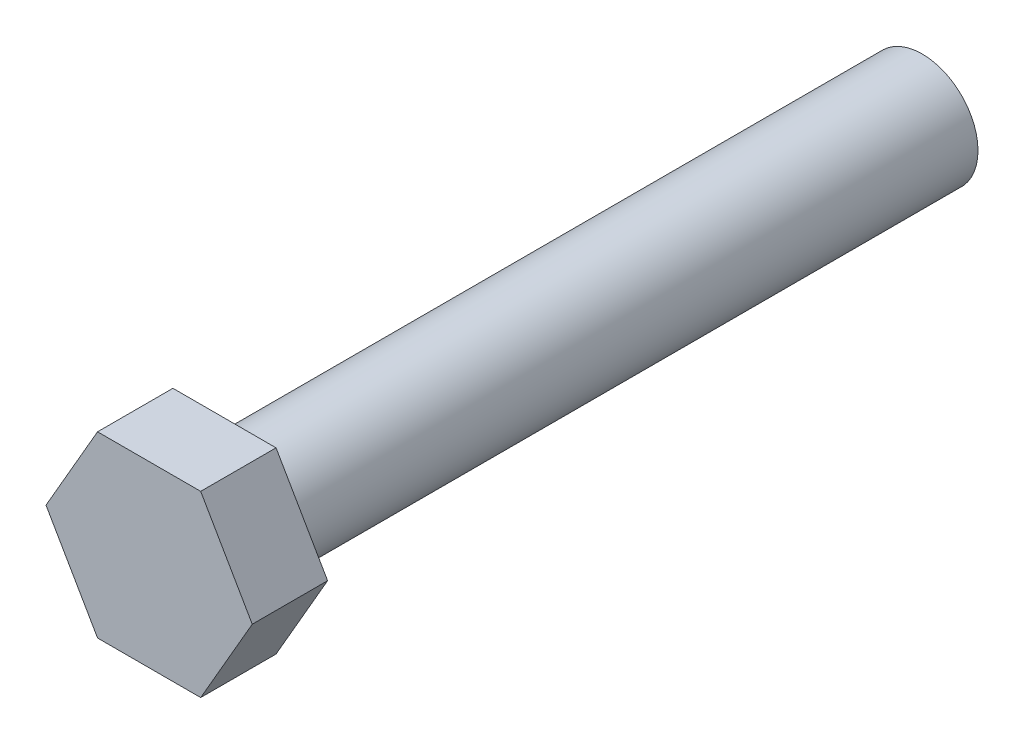
ISO-10303-21;
HEADER;
FILE_DESCRIPTION(('STEP AP214'),'2;1');
FILE_NAME('part.step','',(''),(''),'','','');
FILE_SCHEMA(('AUTOMOTIVE_DESIGN { 1 0 10303 214 1 1 1 1 }'));
ENDSEC;
DATA;
#1=APPLICATION_CONTEXT('core data for automotive mechanical design processes');
#2=APPLICATION_PROTOCOL_DEFINITION('international standard','automotive_design',2000,#1);
#3=PRODUCT_CONTEXT('',#1,'mechanical');
#4=PRODUCT('Part','Part','',(#3));
#5=PRODUCT_RELATED_PRODUCT_CATEGORY('part','',(#4));
#6=PRODUCT_DEFINITION_FORMATION('','',#4);
#7=PRODUCT_DEFINITION_CONTEXT('part definition',#1,'design');
#8=PRODUCT_DEFINITION('design','',#6,#7);
#9=PRODUCT_DEFINITION_SHAPE('','',#8);
#10=(LENGTH_UNIT() NAMED_UNIT(*) SI_UNIT(.MILLI.,.METRE.));
#11=(NAMED_UNIT(*) PLANE_ANGLE_UNIT() SI_UNIT($,.RADIAN.));
#12=(NAMED_UNIT(*) SI_UNIT($,.STERADIAN.) SOLID_ANGLE_UNIT());
#13=UNCERTAINTY_MEASURE_WITH_UNIT(LENGTH_MEASURE(1.E-05),#10,'distance_accuracy_value','');
#14=(GEOMETRIC_REPRESENTATION_CONTEXT(3) GLOBAL_UNCERTAINTY_ASSIGNED_CONTEXT((#13)) GLOBAL_UNIT_ASSIGNED_CONTEXT((#10,
#11,#12)) REPRESENTATION_CONTEXT('',''));
#15=CARTESIAN_POINT('',(0.,0.,0.));
#16=DIRECTION('',(0.,0.,1.));
#17=DIRECTION('',(1.,0.,0.));
#18=AXIS2_PLACEMENT_3D('',#15,#16,#17);
#19=CARTESIAN_POINT('',(0.,0.,50.));
#20=DIRECTION('',(0.,0.,-1.));
#21=DIRECTION('',(-1.,0.,0.));
#22=AXIS2_PLACEMENT_3D('',#19,#20,#21);
#23=CYLINDRICAL_SURFACE('',#22,4.);
#24=CARTESIAN_POINT('',(0.,0.,50.));
#25=DIRECTION('',(0.,0.,1.));
#26=DIRECTION('',(1.,0.,0.));
#27=AXIS2_PLACEMENT_3D('',#24,#25,#26);
#28=CIRCLE('',#27,4.);
#29=CARTESIAN_POINT('',(4.,0.,50.));
#30=VERTEX_POINT('',#29);
#31=EDGE_CURVE('E11',#30,#30,#28,.T.);
#32=ORIENTED_EDGE('',*,*,#31,.F.);
#33=EDGE_LOOP('',(#32));
#34=FACE_BOUND('',#33,.T.);
#35=CARTESIAN_POINT('',(0.,0.,0.));
#36=DIRECTION('',(0.,0.,1.));
#37=DIRECTION('',(1.,0.,0.));
#38=AXIS2_PLACEMENT_3D('',#35,#36,#37);
#39=CIRCLE('',#38,4.);
#40=CARTESIAN_POINT('',(4.,0.,0.));
#41=VERTEX_POINT('',#40);
#42=EDGE_CURVE('E37',#41,#41,#39,.T.);
#43=ORIENTED_EDGE('',*,*,#42,.T.);
#44=EDGE_LOOP('',(#43));
#45=FACE_BOUND('',#44,.T.);
#46=ADVANCED_FACE('F34',(#34,#45),#23,.T.);
#47=CARTESIAN_POINT('',(0.,0.,0.));
#48=DIRECTION('',(0.,0.,1.));
#49=DIRECTION('',(1.,0.,0.));
#50=AXIS2_PLACEMENT_3D('',#47,#48,#49);
#51=PLANE('',#50);
#52=ORIENTED_EDGE('',*,*,#42,.F.);
#53=EDGE_LOOP('',(#52));
#54=FACE_BOUND('',#53,.T.);
#55=ADVANCED_FACE('F142',(#54),#51,.F.);
#56=CARTESIAN_POINT('',(7.39008344562719,0.,50.));
#57=DIRECTION('',(0.,0.,1.));
#58=DIRECTION('',(1.,0.,0.));
#59=AXIS2_PLACEMENT_3D('',#56,#57,#58);
#60=PLANE('',#59);
#61=DIRECTION('',(0.499999999999999,0.866025403784439,0.));
#62=VECTOR('',#61,1.);
#63=CARTESIAN_POINT('',(3.69504172281362,-6.40000000000018,50.));
#64=LINE('',#63,#62);
#65=CARTESIAN_POINT('',(3.69504172281362,-6.40000000000018,50.));
#66=VERTEX_POINT('',#65);
#67=CARTESIAN_POINT('',(7.39008344562719,0.,50.));
#68=VERTEX_POINT('',#67);
#69=EDGE_CURVE('E119',#66,#68,#64,.T.);
#70=ORIENTED_EDGE('',*,*,#69,.F.);
#71=DIRECTION('',(1.,0.,0.));
#72=VECTOR('',#71,1.);
#73=CARTESIAN_POINT('',(-3.69504172281368,-6.40000000000007,50.));
#74=LINE('',#73,#72);
#75=CARTESIAN_POINT('',(-3.69504172281368,-6.40000000000007,50.));
#76=VERTEX_POINT('',#75);
#77=EDGE_CURVE('E79',#76,#66,#74,.T.);
#78=ORIENTED_EDGE('',*,*,#77,.F.);
#79=DIRECTION('',(0.5,-0.866025403784439,0.));
#80=VECTOR('',#79,1.);
#81=CARTESIAN_POINT('',(-7.39008344562722,0.,50.));
#82=LINE('',#81,#80);
#83=CARTESIAN_POINT('',(-7.39008344562722,0.,50.));
#84=VERTEX_POINT('',#83);
#85=EDGE_CURVE('E73',#84,#76,#82,.T.);
#86=ORIENTED_EDGE('',*,*,#85,.F.);
#87=DIRECTION('',(-0.5,-0.866025403784439,0.));
#88=VECTOR('',#87,1.);
#89=CARTESIAN_POINT('',(-3.69504172281362,6.39999999999996,50.));
#90=LINE('',#89,#88);
#91=CARTESIAN_POINT('',(-3.69504172281362,6.39999999999996,50.));
#92=VERTEX_POINT('',#91);
#93=EDGE_CURVE('E109',#92,#84,#90,.T.);
#94=ORIENTED_EDGE('',*,*,#93,.F.);
#95=DIRECTION('',(-1.,0.,0.));
#96=VECTOR('',#95,1.);
#97=CARTESIAN_POINT('',(3.69504172281351,6.39999999999996,50.));
#98=LINE('',#97,#96);
#99=CARTESIAN_POINT('',(3.69504172281351,6.39999999999996,50.));
#100=VERTEX_POINT('',#99);
#101=EDGE_CURVE('E124',#100,#92,#98,.T.);
#102=ORIENTED_EDGE('',*,*,#101,.F.);
#103=DIRECTION('',(-0.5,0.866025403784439,0.));
#104=VECTOR('',#103,1.);
#105=CARTESIAN_POINT('',(7.39008344562719,0.,50.));
#106=LINE('',#105,#104);
#107=EDGE_CURVE('E122',#68,#100,#106,.T.);
#108=ORIENTED_EDGE('',*,*,#107,.F.);
#109=EDGE_LOOP('',(#70,#78,#86,#94,#102,#108));
#110=FACE_BOUND('',#109,.T.);
#111=ORIENTED_EDGE('',*,*,#31,.T.);
#112=EDGE_LOOP('',(#111));
#113=FACE_BOUND('',#112,.T.);
#114=ADVANCED_FACE('F144',(#110,#113),#60,.F.);
#115=CARTESIAN_POINT('',(3.69504172281362,-6.40000000000018,55.4));
#116=DIRECTION('',(-0.866025403784439,0.5,0.));
#117=DIRECTION('',(-0.499999999999999,-0.866025403784439,0.));
#118=AXIS2_PLACEMENT_3D('',#115,#116,#117);
#119=PLANE('',#118);
#120=ORIENTED_EDGE('',*,*,#69,.T.);
#121=DIRECTION('',(0.,0.,-1.));
#122=VECTOR('',#121,1.);
#123=CARTESIAN_POINT('',(7.39008344562719,0.,55.4));
#124=LINE('',#123,#122);
#125=CARTESIAN_POINT('',(7.39008344562719,0.,55.4));
#126=VERTEX_POINT('',#125);
#127=EDGE_CURVE('E136',#126,#68,#124,.T.);
#128=ORIENTED_EDGE('',*,*,#127,.F.);
#129=DIRECTION('',(0.499999999999999,0.866025403784439,0.));
#130=VECTOR('',#129,1.);
#131=CARTESIAN_POINT('',(3.69504172281362,-6.40000000000018,55.4));
#132=LINE('',#131,#130);
#133=CARTESIAN_POINT('',(3.69504172281362,-6.40000000000018,55.4));
#134=VERTEX_POINT('',#133);
#135=EDGE_CURVE('E129',#134,#126,#132,.T.);
#136=ORIENTED_EDGE('',*,*,#135,.F.);
#137=DIRECTION('',(0.,0.,-1.));
#138=VECTOR('',#137,1.);
#139=CARTESIAN_POINT('',(3.69504172281362,-6.40000000000018,55.4));
#140=LINE('',#139,#138);
#141=EDGE_CURVE('E115',#134,#66,#140,.T.);
#142=ORIENTED_EDGE('',*,*,#141,.T.);
#143=EDGE_LOOP('',(#120,#128,#136,#142));
#144=FACE_BOUND('',#143,.T.);
#145=ADVANCED_FACE('F149',(#144),#119,.F.);
#146=CARTESIAN_POINT('',(7.39008344562719,0.,55.4));
#147=DIRECTION('',(-0.866025403784438,-0.5,0.));
#148=DIRECTION('',(0.5,-0.866025403784439,0.));
#149=AXIS2_PLACEMENT_3D('',#146,#147,#148);
#150=PLANE('',#149);
#151=ORIENTED_EDGE('',*,*,#107,.T.);
#152=DIRECTION('',(0.,0.,-1.));
#153=VECTOR('',#152,1.);
#154=CARTESIAN_POINT('',(3.69504172281351,6.39999999999996,55.4));
#155=LINE('',#154,#153);
#156=CARTESIAN_POINT('',(3.69504172281351,6.39999999999996,55.4));
#157=VERTEX_POINT('',#156);
#158=EDGE_CURVE('E133',#157,#100,#155,.T.);
#159=ORIENTED_EDGE('',*,*,#158,.F.);
#160=DIRECTION('',(-0.5,0.866025403784439,0.));
#161=VECTOR('',#160,1.);
#162=CARTESIAN_POINT('',(7.39008344562719,0.,55.4));
#163=LINE('',#162,#161);
#164=EDGE_CURVE('E88',#126,#157,#163,.T.);
#165=ORIENTED_EDGE('',*,*,#164,.F.);
#166=ORIENTED_EDGE('',*,*,#127,.T.);
#167=EDGE_LOOP('',(#151,#159,#165,#166));
#168=FACE_BOUND('',#167,.T.);
#169=ADVANCED_FACE('F156',(#168),#150,.F.);
#170=CARTESIAN_POINT('',(3.69504172281351,6.39999999999996,55.4));
#171=DIRECTION('',(0.,-1.,0.));
#172=DIRECTION('',(0.,0.,-1.));
#173=AXIS2_PLACEMENT_3D('',#170,#171,#172);
#174=PLANE('',#173);
#175=ORIENTED_EDGE('',*,*,#101,.T.);
#176=DIRECTION('',(0.,0.,-1.));
#177=VECTOR('',#176,1.);
#178=CARTESIAN_POINT('',(-3.69504172281362,6.39999999999996,55.4));
#179=LINE('',#178,#177);
#180=CARTESIAN_POINT('',(-3.69504172281362,6.39999999999996,55.4));
#181=VERTEX_POINT('',#180);
#182=EDGE_CURVE('E110',#181,#92,#179,.T.);
#183=ORIENTED_EDGE('',*,*,#182,.F.);
#184=DIRECTION('',(-1.,0.,0.));
#185=VECTOR('',#184,1.);
#186=CARTESIAN_POINT('',(3.69504172281351,6.39999999999996,55.4));
#187=LINE('',#186,#185);
#188=EDGE_CURVE('E101',#157,#181,#187,.T.);
#189=ORIENTED_EDGE('',*,*,#188,.F.);
#190=ORIENTED_EDGE('',*,*,#158,.T.);
#191=EDGE_LOOP('',(#175,#183,#189,#190));
#192=FACE_BOUND('',#191,.T.);
#193=ADVANCED_FACE('F160',(#192),#174,.F.);
#194=CARTESIAN_POINT('',(-3.69504172281362,6.39999999999996,55.4));
#195=DIRECTION('',(0.866025403784438,-0.5,0.));
#196=DIRECTION('',(0.5,0.866025403784439,0.));
#197=AXIS2_PLACEMENT_3D('',#194,#195,#196);
#198=PLANE('',#197);
#199=ORIENTED_EDGE('',*,*,#93,.T.);
#200=DIRECTION('',(0.,0.,-1.));
#201=VECTOR('',#200,1.);
#202=CARTESIAN_POINT('',(-7.39008344562722,0.,55.4));
#203=LINE('',#202,#201);
#204=CARTESIAN_POINT('',(-7.39008344562722,0.,55.4));
#205=VERTEX_POINT('',#204);
#206=EDGE_CURVE('E106',#205,#84,#203,.T.);
#207=ORIENTED_EDGE('',*,*,#206,.F.);
#208=DIRECTION('',(-0.5,-0.866025403784439,0.));
#209=VECTOR('',#208,1.);
#210=CARTESIAN_POINT('',(-3.69504172281362,6.39999999999996,55.4));
#211=LINE('',#210,#209);
#212=EDGE_CURVE('E95',#181,#205,#211,.T.);
#213=ORIENTED_EDGE('',*,*,#212,.F.);
#214=ORIENTED_EDGE('',*,*,#182,.T.);
#215=EDGE_LOOP('',(#199,#207,#213,#214));
#216=FACE_BOUND('',#215,.T.);
#217=ADVANCED_FACE('F107',(#216),#198,.F.);
#218=CARTESIAN_POINT('',(-7.39008344562722,0.,55.4));
#219=DIRECTION('',(0.866025403784438,0.5,0.));
#220=DIRECTION('',(-0.5,0.866025403784439,0.));
#221=AXIS2_PLACEMENT_3D('',#218,#219,#220);
#222=PLANE('',#221);
#223=ORIENTED_EDGE('',*,*,#85,.T.);
#224=DIRECTION('',(0.,0.,-1.));
#225=VECTOR('',#224,1.);
#226=CARTESIAN_POINT('',(-3.69504172281368,-6.40000000000007,55.4));
#227=LINE('',#226,#225);
#228=CARTESIAN_POINT('',(-3.69504172281368,-6.40000000000007,55.4));
#229=VERTEX_POINT('',#228);
#230=EDGE_CURVE('E111',#229,#76,#227,.T.);
#231=ORIENTED_EDGE('',*,*,#230,.F.);
#232=DIRECTION('',(0.5,-0.866025403784439,0.));
#233=VECTOR('',#232,1.);
#234=CARTESIAN_POINT('',(-7.39008344562722,0.,55.4));
#235=LINE('',#234,#233);
#236=EDGE_CURVE('E99',#205,#229,#235,.T.);
#237=ORIENTED_EDGE('',*,*,#236,.F.);
#238=ORIENTED_EDGE('',*,*,#206,.T.);
#239=EDGE_LOOP('',(#223,#231,#237,#238));
#240=FACE_BOUND('',#239,.T.);
#241=ADVANCED_FACE('F113',(#240),#222,.F.);
#242=CARTESIAN_POINT('',(-3.69504172281368,-6.40000000000007,55.4));
#243=DIRECTION('',(0.,1.,0.));
#244=DIRECTION('',(-1.,0.,0.));
#245=AXIS2_PLACEMENT_3D('',#242,#243,#244);
#246=PLANE('',#245);
#247=ORIENTED_EDGE('',*,*,#77,.T.);
#248=ORIENTED_EDGE('',*,*,#141,.F.);
#249=DIRECTION('',(1.,0.,0.));
#250=VECTOR('',#249,1.);
#251=CARTESIAN_POINT('',(-3.69504172281368,-6.40000000000007,55.4));
#252=LINE('',#251,#250);
#253=EDGE_CURVE('E50',#229,#134,#252,.T.);
#254=ORIENTED_EDGE('',*,*,#253,.F.);
#255=ORIENTED_EDGE('',*,*,#230,.T.);
#256=EDGE_LOOP('',(#247,#248,#254,#255));
#257=FACE_BOUND('',#256,.T.);
#258=ADVANCED_FACE('F168',(#257),#246,.F.);
#259=CARTESIAN_POINT('',(7.39008344562719,0.,55.4));
#260=DIRECTION('',(0.,0.,1.));
#261=DIRECTION('',(1.,0.,0.));
#262=AXIS2_PLACEMENT_3D('',#259,#260,#261);
#263=PLANE('',#262);
#264=ORIENTED_EDGE('',*,*,#135,.T.);
#265=ORIENTED_EDGE('',*,*,#164,.T.);
#266=ORIENTED_EDGE('',*,*,#188,.T.);
#267=ORIENTED_EDGE('',*,*,#212,.T.);
#268=ORIENTED_EDGE('',*,*,#236,.T.);
#269=ORIENTED_EDGE('',*,*,#253,.T.);
#270=EDGE_LOOP('',(#264,#265,#266,#267,#268,#269));
#271=FACE_BOUND('',#270,.T.);
#272=ADVANCED_FACE('F97',(#271),#263,.T.);
#273=CLOSED_SHELL('',(#46,#55,#114,#145,#169,#193,#217,#241,#258,#272));
#274=MANIFOLD_SOLID_BREP('B2',#273);
#275=ADVANCED_BREP_SHAPE_REPRESENTATION('',(#18,#274),#14);
#276=SHAPE_DEFINITION_REPRESENTATION(#9,#275);
ENDSEC;
END-ISO-10303-21;
